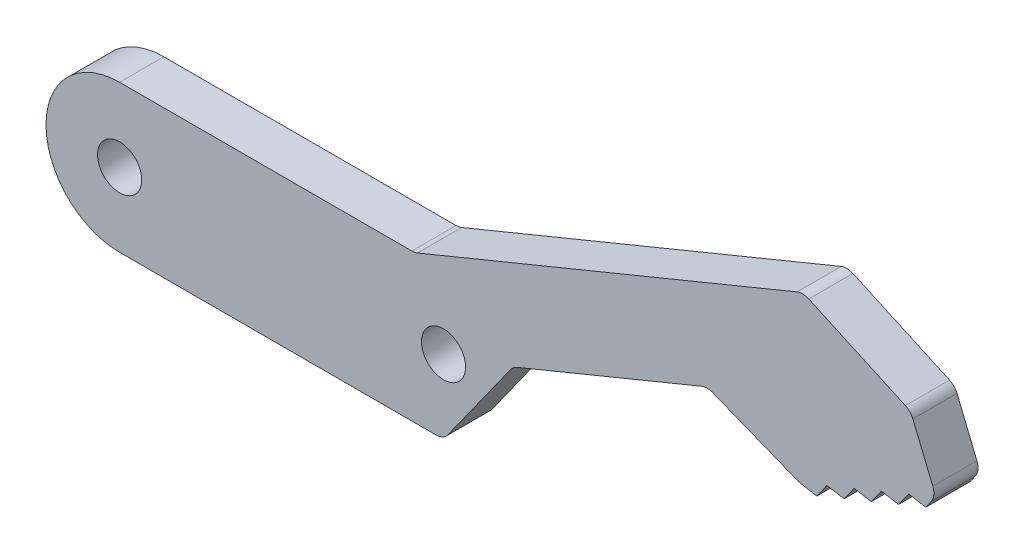
ISO-10303-21;
HEADER;
FILE_DESCRIPTION(('STEP AP214'),'2;1');
FILE_NAME('part.step','',(''),(''),'','','');
FILE_SCHEMA(('AUTOMOTIVE_DESIGN { 1 0 10303 214 1 1 1 1 }'));
ENDSEC;
DATA;
#1=APPLICATION_CONTEXT('core data for automotive mechanical design processes');
#2=APPLICATION_PROTOCOL_DEFINITION('international standard','automotive_design',2000,#1);
#3=PRODUCT_CONTEXT('',#1,'mechanical');
#4=PRODUCT('Part','Part','',(#3));
#5=PRODUCT_RELATED_PRODUCT_CATEGORY('part','',(#4));
#6=PRODUCT_DEFINITION_FORMATION('','',#4);
#7=PRODUCT_DEFINITION_CONTEXT('part definition',#1,'design');
#8=PRODUCT_DEFINITION('design','',#6,#7);
#9=PRODUCT_DEFINITION_SHAPE('','',#8);
#10=(LENGTH_UNIT() NAMED_UNIT(*) SI_UNIT(.MILLI.,.METRE.));
#11=(NAMED_UNIT(*) PLANE_ANGLE_UNIT() SI_UNIT($,.RADIAN.));
#12=(NAMED_UNIT(*) SI_UNIT($,.STERADIAN.) SOLID_ANGLE_UNIT());
#13=UNCERTAINTY_MEASURE_WITH_UNIT(LENGTH_MEASURE(1.E-05),#10,'distance_accuracy_value','');
#14=(GEOMETRIC_REPRESENTATION_CONTEXT(3) GLOBAL_UNCERTAINTY_ASSIGNED_CONTEXT((#13)) GLOBAL_UNIT_ASSIGNED_CONTEXT((#10,
#11,#12)) REPRESENTATION_CONTEXT('',''));
#15=CARTESIAN_POINT('',(0.,0.,0.));
#16=DIRECTION('',(0.,0.,1.));
#17=DIRECTION('',(1.,0.,0.));
#18=AXIS2_PLACEMENT_3D('',#15,#16,#17);
#19=CARTESIAN_POINT('',(16.9314341640706,-12.095211761983,3.));
#20=DIRECTION('',(0.813703233651607,-0.581280523968349,0.));
#21=DIRECTION('',(0.581280523968349,0.813703233651607,0.));
#22=AXIS2_PLACEMENT_3D('',#19,#20,#21);
#23=PLANE('',#22);
#24=DIRECTION('',(-0.581280523968349,-0.813703233651607,0.));
#25=VECTOR('',#24,1.);
#26=CARTESIAN_POINT('',(16.9314341640706,-12.095211761983,0.));
#27=LINE('',#26,#25);
#28=CARTESIAN_POINT('',(26.562618493048,1.38696338278467,0.));
#29=VERTEX_POINT('',#28);
#30=CARTESIAN_POINT('',(22.2991182366711,-4.58128052396835,0.));
#31=VERTEX_POINT('',#30);
#32=EDGE_CURVE('E370',#29,#31,#27,.T.);
#33=ORIENTED_EDGE('',*,*,#32,.F.);
#34=DIRECTION('',(0.,0.,-1.));
#35=VECTOR('',#34,1.);
#36=CARTESIAN_POINT('',(26.562618493048,1.38696338278467,3.));
#37=LINE('',#36,#35);
#38=CARTESIAN_POINT('',(26.562618493048,1.38696338278467,3.));
#39=VERTEX_POINT('',#38);
#40=EDGE_CURVE('E337',#29,#39,#37,.F.);
#41=ORIENTED_EDGE('',*,*,#40,.T.);
#42=DIRECTION('',(-0.581280523968349,-0.813703233651607,0.));
#43=VECTOR('',#42,1.);
#44=CARTESIAN_POINT('',(16.9314341640706,-12.095211761983,3.));
#45=LINE('',#44,#43);
#46=CARTESIAN_POINT('',(22.2991182366711,-4.58128052396835,3.));
#47=VERTEX_POINT('',#46);
#48=EDGE_CURVE('E382',#39,#47,#45,.T.);
#49=ORIENTED_EDGE('',*,*,#48,.T.);
#50=DIRECTION('',(0.,0.,-1.));
#51=VECTOR('',#50,1.);
#52=CARTESIAN_POINT('',(22.2991182366711,-4.58128052396835,0.));
#53=LINE('',#52,#51);
#54=EDGE_CURVE('E333',#47,#31,#53,.T.);
#55=ORIENTED_EDGE('',*,*,#54,.T.);
#56=EDGE_LOOP('',(#33,#41,#49,#55));
#57=FACE_BOUND('',#56,.T.);
#58=ADVANCED_FACE('F41',(#57),#23,.T.);
#59=CARTESIAN_POINT('',(3.2950033831404,-8.01412070884608,3.));
#60=DIRECTION('',(0.380263412733207,-0.924878228166549,0.));
#61=DIRECTION('',(0.924878228166549,0.380263412733207,0.));
#62=AXIS2_PLACEMENT_3D('',#59,#60,#61);
#63=PLANE('',#62);
#64=DIRECTION('',(-0.924878228166549,-0.380263412733207,0.));
#65=VECTOR('',#64,1.);
#66=CARTESIAN_POINT('',(3.2950033831404,-8.01412070884608,3.));
#67=LINE('',#66,#65);
#68=CARTESIAN_POINT('',(39.5264893293259,6.88244413040184,3.));
#69=VERTEX_POINT('',#68);
#70=CARTESIAN_POINT('',(26.9960583139664,1.73056108698287,3.));
#71=VERTEX_POINT('',#70);
#72=EDGE_CURVE('E375',#69,#71,#67,.T.);
#73=ORIENTED_EDGE('',*,*,#72,.T.);
#74=DIRECTION('',(0.,0.,-1.));
#75=VECTOR('',#74,1.);
#76=CARTESIAN_POINT('',(26.9960583139664,1.73056108698286,0.));
#77=LINE('',#76,#75);
#78=CARTESIAN_POINT('',(26.9960583139664,1.73056108698287,0.));
#79=VERTEX_POINT('',#78);
#80=EDGE_CURVE('E329',#71,#79,#77,.T.);
#81=ORIENTED_EDGE('',*,*,#80,.T.);
#82=DIRECTION('',(-0.924878228166549,-0.380263412733207,0.));
#83=VECTOR('',#82,1.);
#84=CARTESIAN_POINT('',(3.2950033831404,-8.01412070884608,0.));
#85=LINE('',#84,#83);
#86=CARTESIAN_POINT('',(39.5264893293259,6.88244413040184,0.));
#87=VERTEX_POINT('',#86);
#88=EDGE_CURVE('E358',#87,#79,#85,.T.);
#89=ORIENTED_EDGE('',*,*,#88,.F.);
#90=DIRECTION('',(0.,0.,-1.));
#91=VECTOR('',#90,1.);
#92=CARTESIAN_POINT('',(39.5264893293259,6.88244413040183,3.));
#93=LINE('',#92,#91);
#94=EDGE_CURVE('E326',#87,#69,#93,.F.);
#95=ORIENTED_EDGE('',*,*,#94,.T.);
#96=EDGE_LOOP('',(#73,#81,#89,#95));
#97=FACE_BOUND('',#96,.T.);
#98=ADVANCED_FACE('F366',(#97),#63,.T.);
#99=CARTESIAN_POINT('',(7.84369243763637,19.7605066346556,3.));
#100=DIRECTION('',(-0.368935795459582,-0.929454882621317,0.));
#101=DIRECTION('',(0.929454882621317,-0.368935795459582,0.));
#102=AXIS2_PLACEMENT_3D('',#99,#100,#101);
#103=PLANE('',#102);
#104=DIRECTION('',(-0.929454882621317,0.368935795459582,0.));
#105=VECTOR('',#104,1.);
#106=CARTESIAN_POINT('',(7.84369243763637,19.7605066346556,0.));
#107=LINE('',#106,#105);
#108=CARTESIAN_POINT('',(46.0925277874036,4.57809729019015,0.));
#109=VERTEX_POINT('',#108);
#110=CARTESIAN_POINT('',(40.2756885375187,6.8870207848566,0.));
#111=VERTEX_POINT('',#110);
#112=EDGE_CURVE('E360',#109,#111,#107,.T.);
#113=ORIENTED_EDGE('',*,*,#112,.F.);
#114=DIRECTION('',(0.,0.,-1.));
#115=VECTOR('',#114,1.);
#116=CARTESIAN_POINT('',(46.0925277874036,4.57809729019016,3.));
#117=LINE('',#116,#115);
#118=CARTESIAN_POINT('',(46.0925277874036,4.57809729019015,3.));
#119=VERTEX_POINT('',#118);
#120=EDGE_CURVE('E281',#109,#119,#117,.F.);
#121=ORIENTED_EDGE('',*,*,#120,.T.);
#122=DIRECTION('',(-0.929454882621317,0.368935795459582,0.));
#123=VECTOR('',#122,1.);
#124=CARTESIAN_POINT('',(7.84369243763637,19.7605066346556,3.));
#125=LINE('',#124,#123);
#126=CARTESIAN_POINT('',(40.2756885375187,6.8870207848566,3.));
#127=VERTEX_POINT('',#126);
#128=EDGE_CURVE('E236',#119,#127,#125,.T.);
#129=ORIENTED_EDGE('',*,*,#128,.T.);
#130=DIRECTION('',(0.,0.,-1.));
#131=VECTOR('',#130,1.);
#132=CARTESIAN_POINT('',(40.2756885375187,6.88702078485661,0.));
#133=LINE('',#132,#131);
#134=EDGE_CURVE('E277',#127,#111,#133,.T.);
#135=ORIENTED_EDGE('',*,*,#134,.T.);
#136=EDGE_LOOP('',(#113,#121,#129,#135));
#137=FACE_BOUND('',#136,.T.);
#138=ADVANCED_FACE('F377',(#137),#103,.T.);
#139=CARTESIAN_POINT('',(2.1206872505527,12.200106201943,3.));
#140=DIRECTION('',(0.171257275030372,0.985226342395072,0.));
#141=DIRECTION('',(-0.985226342395072,0.171257275030372,0.));
#142=AXIS2_PLACEMENT_3D('',#139,#140,#141);
#143=PLANE('',#142);
#144=DIRECTION('',(0.985226342395072,-0.171257275030372,0.));
#145=VECTOR('',#144,1.);
#146=CARTESIAN_POINT('',(2.1206872505527,12.200106201943,3.));
#147=LINE('',#146,#145);
#148=CARTESIAN_POINT('',(46.2902063078328,4.5223258304164,3.));
#149=VERTEX_POINT('',#148);
#150=CARTESIAN_POINT('',(47.3529322035688,4.33759717145107,3.));
#151=VERTEX_POINT('',#150);
#152=EDGE_CURVE('E222',#149,#151,#147,.T.);
#153=ORIENTED_EDGE('',*,*,#152,.F.);
#154=DIRECTION('',(0.,0.,-1.));
#155=VECTOR('',#154,1.);
#156=CARTESIAN_POINT('',(46.2902063078328,4.5223258304164,0.));
#157=LINE('',#156,#155);
#158=CARTESIAN_POINT('',(46.2902063078328,4.5223258304164,0.));
#159=VERTEX_POINT('',#158);
#160=EDGE_CURVE('E253',#149,#159,#157,.T.);
#161=ORIENTED_EDGE('',*,*,#160,.T.);
#162=DIRECTION('',(0.985226342395072,-0.171257275030372,0.));
#163=VECTOR('',#162,1.);
#164=CARTESIAN_POINT('',(2.1206872505527,12.200106201943,0.));
#165=LINE('',#164,#163);
#166=CARTESIAN_POINT('',(47.3529322035688,4.33759717145107,0.));
#167=VERTEX_POINT('',#166);
#168=EDGE_CURVE('E250',#159,#167,#165,.T.);
#169=ORIENTED_EDGE('',*,*,#168,.T.);
#170=DIRECTION('',(0.,0.,-1.));
#171=VECTOR('',#170,1.);
#172=CARTESIAN_POINT('',(47.3529322035688,4.33759717145107,3.));
#173=LINE('',#172,#171);
#174=EDGE_CURVE('E242',#151,#167,#173,.T.);
#175=ORIENTED_EDGE('',*,*,#174,.F.);
#176=EDGE_LOOP('',(#153,#161,#169,#175));
#177=FACE_BOUND('',#176,.T.);
#178=ADVANCED_FACE('F248',(#177),#143,.F.);
#179=CARTESIAN_POINT('',(29.3832302084348,-20.911746854221,3.));
#180=DIRECTION('',(-0.814732571298571,0.579836905746106,0.));
#181=DIRECTION('',(-0.579836905746106,-0.814732571298571,0.));
#182=AXIS2_PLACEMENT_3D('',#179,#180,#181);
#183=PLANE('',#182);
#184=DIRECTION('',(0.579836905746106,0.814732571298571,0.));
#185=VECTOR('',#184,1.);
#186=CARTESIAN_POINT('',(29.3832302084348,-20.911746854221,0.));
#187=LINE('',#186,#185);
#188=CARTESIAN_POINT('',(48.0382444817135,5.30053386792921,0.));
#189=VERTEX_POINT('',#188);
#190=EDGE_CURVE('E454',#167,#189,#187,.T.);
#191=ORIENTED_EDGE('',*,*,#190,.T.);
#192=DIRECTION('',(0.,0.,-1.));
#193=VECTOR('',#192,1.);
#194=CARTESIAN_POINT('',(48.0382444817135,5.30053386792921,3.));
#195=LINE('',#194,#193);
#196=CARTESIAN_POINT('',(48.0382444817135,5.30053386792921,3.));
#197=VERTEX_POINT('',#196);
#198=EDGE_CURVE('E244',#197,#189,#195,.T.);
#199=ORIENTED_EDGE('',*,*,#198,.F.);
#200=DIRECTION('',(0.579836905746106,0.814732571298571,0.));
#201=VECTOR('',#200,1.);
#202=CARTESIAN_POINT('',(29.3832302084348,-20.911746854221,3.));
#203=LINE('',#202,#201);
#204=EDGE_CURVE('E227',#151,#197,#203,.T.);
#205=ORIENTED_EDGE('',*,*,#204,.F.);
#206=ORIENTED_EDGE('',*,*,#174,.T.);
#207=EDGE_LOOP('',(#191,#199,#205,#206));
#208=FACE_BOUND('',#207,.T.);
#209=ADVANCED_FACE('F241',(#208),#183,.F.);
#210=CARTESIAN_POINT('',(2.30326040358784,13.2504316830208,3.));
#211=DIRECTION('',(0.171257275030372,0.985226342395072,0.));
#212=DIRECTION('',(-0.985226342395072,0.171257275030372,0.));
#213=AXIS2_PLACEMENT_3D('',#210,#211,#212);
#214=PLANE('',#213);
#215=DIRECTION('',(0.985226342395072,-0.171257275030372,0.));
#216=VECTOR('',#215,1.);
#217=CARTESIAN_POINT('',(2.30326040358784,13.2504316830208,0.));
#218=LINE('',#217,#216);
#219=CARTESIAN_POINT('',(49.2026886599019,5.09812399691748,0.));
#220=VERTEX_POINT('',#219);
#221=EDGE_CURVE('E457',#189,#220,#218,.T.);
#222=ORIENTED_EDGE('',*,*,#221,.T.);
#223=DIRECTION('',(0.,0.,-1.));
#224=VECTOR('',#223,1.);
#225=CARTESIAN_POINT('',(49.2026886599019,5.09812399691748,3.));
#226=LINE('',#225,#224);
#227=CARTESIAN_POINT('',(49.2026886599019,5.09812399691748,3.));
#228=VERTEX_POINT('',#227);
#229=EDGE_CURVE('E259',#228,#220,#226,.T.);
#230=ORIENTED_EDGE('',*,*,#229,.F.);
#231=DIRECTION('',(0.985226342395072,-0.171257275030372,0.));
#232=VECTOR('',#231,1.);
#233=CARTESIAN_POINT('',(2.30326040358784,13.2504316830208,3.));
#234=LINE('',#233,#232);
#235=EDGE_CURVE('E246',#197,#228,#234,.T.);
#236=ORIENTED_EDGE('',*,*,#235,.F.);
#237=ORIENTED_EDGE('',*,*,#198,.T.);
#238=EDGE_LOOP('',(#222,#230,#236,#237));
#239=FACE_BOUND('',#238,.T.);
#240=ADVANCED_FACE('F549',(#239),#214,.F.);
#241=CARTESIAN_POINT('',(30.2517964891725,-21.5298966648461,3.));
#242=DIRECTION('',(-0.814732571298572,0.579836905746105,0.));
#243=DIRECTION('',(-0.579836905746105,-0.814732571298572,0.));
#244=AXIS2_PLACEMENT_3D('',#241,#242,#243);
#245=PLANE('',#244);
#246=DIRECTION('',(0.579836905746105,0.814732571298572,0.));
#247=VECTOR('',#246,1.);
#248=CARTESIAN_POINT('',(30.2517964891725,-21.5298966648461,0.));
#249=LINE('',#248,#247);
#250=CARTESIAN_POINT('',(49.8880009380465,6.06106069339561,0.));
#251=VERTEX_POINT('',#250);
#252=EDGE_CURVE('E461',#220,#251,#249,.T.);
#253=ORIENTED_EDGE('',*,*,#252,.T.);
#254=DIRECTION('',(0.,0.,-1.));
#255=VECTOR('',#254,1.);
#256=CARTESIAN_POINT('',(49.8880009380465,6.06106069339561,3.));
#257=LINE('',#256,#255);
#258=CARTESIAN_POINT('',(49.8880009380465,6.06106069339561,3.));
#259=VERTEX_POINT('',#258);
#260=EDGE_CURVE('E539',#259,#251,#257,.T.);
#261=ORIENTED_EDGE('',*,*,#260,.F.);
#262=DIRECTION('',(0.579836905746105,0.814732571298572,0.));
#263=VECTOR('',#262,1.);
#264=CARTESIAN_POINT('',(30.2517964891725,-21.5298966648461,3.));
#265=LINE('',#264,#263);
#266=EDGE_CURVE('E388',#228,#259,#265,.T.);
#267=ORIENTED_EDGE('',*,*,#266,.F.);
#268=ORIENTED_EDGE('',*,*,#229,.T.);
#269=EDGE_LOOP('',(#253,#261,#267,#268));
#270=FACE_BOUND('',#269,.T.);
#271=ADVANCED_FACE('F546',(#270),#245,.F.);
#272=CARTESIAN_POINT('',(2.48583355662275,14.3007571640981,3.));
#273=DIRECTION('',(0.171257275030362,0.985226342395074,0.));
#274=DIRECTION('',(-0.985226342395074,0.171257275030362,0.));
#275=AXIS2_PLACEMENT_3D('',#272,#273,#274);
#276=PLANE('',#275);
#277=DIRECTION('',(0.985226342395074,-0.171257275030362,0.));
#278=VECTOR('',#277,1.);
#279=CARTESIAN_POINT('',(2.48583355662275,14.3007571640981,0.));
#280=LINE('',#279,#278);
#281=CARTESIAN_POINT('',(51.052445116235,5.8586508223839,0.));
#282=VERTEX_POINT('',#281);
#283=EDGE_CURVE('E465',#251,#282,#280,.T.);
#284=ORIENTED_EDGE('',*,*,#283,.T.);
#285=DIRECTION('',(0.,0.,-1.));
#286=VECTOR('',#285,1.);
#287=CARTESIAN_POINT('',(51.052445116235,5.8586508223839,3.));
#288=LINE('',#287,#286);
#289=CARTESIAN_POINT('',(51.052445116235,5.8586508223839,3.));
#290=VERTEX_POINT('',#289);
#291=EDGE_CURVE('E535',#290,#282,#288,.T.);
#292=ORIENTED_EDGE('',*,*,#291,.F.);
#293=DIRECTION('',(0.985226342395074,-0.171257275030362,0.));
#294=VECTOR('',#293,1.);
#295=CARTESIAN_POINT('',(2.48583355662275,14.3007571640981,3.));
#296=LINE('',#295,#294);
#297=EDGE_CURVE('E392',#259,#290,#296,.T.);
#298=ORIENTED_EDGE('',*,*,#297,.F.);
#299=ORIENTED_EDGE('',*,*,#260,.T.);
#300=EDGE_LOOP('',(#284,#292,#298,#299));
#301=FACE_BOUND('',#300,.T.);
#302=ADVANCED_FACE('F552',(#301),#276,.F.);
#303=CARTESIAN_POINT('',(31.1203627699109,-22.1480464754711,3.));
#304=DIRECTION('',(-0.81473257129858,0.579836905746093,0.));
#305=DIRECTION('',(-0.579836905746093,-0.81473257129858,0.));
#306=AXIS2_PLACEMENT_3D('',#303,#304,#305);
#307=PLANE('',#306);
#308=DIRECTION('',(0.579836905746093,0.81473257129858,0.));
#309=VECTOR('',#308,1.);
#310=CARTESIAN_POINT('',(31.1203627699109,-22.1480464754711,0.));
#311=LINE('',#310,#309);
#312=CARTESIAN_POINT('',(51.7377573943796,6.82158751886202,0.));
#313=VERTEX_POINT('',#312);
#314=EDGE_CURVE('E469',#282,#313,#311,.T.);
#315=ORIENTED_EDGE('',*,*,#314,.T.);
#316=DIRECTION('',(0.,0.,-1.));
#317=VECTOR('',#316,1.);
#318=CARTESIAN_POINT('',(51.7377573943796,6.82158751886202,3.));
#319=LINE('',#318,#317);
#320=CARTESIAN_POINT('',(51.7377573943796,6.82158751886202,3.));
#321=VERTEX_POINT('',#320);
#322=EDGE_CURVE('E531',#321,#313,#319,.T.);
#323=ORIENTED_EDGE('',*,*,#322,.F.);
#324=DIRECTION('',(0.579836905746093,0.81473257129858,0.));
#325=VECTOR('',#324,1.);
#326=CARTESIAN_POINT('',(31.1203627699109,-22.1480464754711,3.));
#327=LINE('',#326,#325);
#328=EDGE_CURVE('E396',#290,#321,#327,.T.);
#329=ORIENTED_EDGE('',*,*,#328,.F.);
#330=ORIENTED_EDGE('',*,*,#291,.T.);
#331=EDGE_LOOP('',(#315,#323,#329,#330));
#332=FACE_BOUND('',#331,.T.);
#333=ADVANCED_FACE('F556',(#332),#307,.F.);
#334=CARTESIAN_POINT('',(2.66840670965787,15.3510826451758,3.));
#335=DIRECTION('',(0.171257275030363,0.985226342395073,0.));
#336=DIRECTION('',(-0.985226342395074,0.171257275030363,0.));
#337=AXIS2_PLACEMENT_3D('',#334,#335,#336);
#338=PLANE('',#337);
#339=DIRECTION('',(0.985226342395074,-0.171257275030363,0.));
#340=VECTOR('',#339,1.);
#341=CARTESIAN_POINT('',(2.66840670965787,15.3510826451758,0.));
#342=LINE('',#341,#340);
#343=CARTESIAN_POINT('',(52.9022015725681,6.6191776478503,0.));
#344=VERTEX_POINT('',#343);
#345=EDGE_CURVE('E473',#313,#344,#342,.T.);
#346=ORIENTED_EDGE('',*,*,#345,.T.);
#347=DIRECTION('',(0.,0.,-1.));
#348=VECTOR('',#347,1.);
#349=CARTESIAN_POINT('',(52.9022015725681,6.6191776478503,3.));
#350=LINE('',#349,#348);
#351=CARTESIAN_POINT('',(52.9022015725681,6.6191776478503,3.));
#352=VERTEX_POINT('',#351);
#353=EDGE_CURVE('E527',#352,#344,#350,.T.);
#354=ORIENTED_EDGE('',*,*,#353,.F.);
#355=DIRECTION('',(0.985226342395074,-0.171257275030363,0.));
#356=VECTOR('',#355,1.);
#357=CARTESIAN_POINT('',(2.66840670965787,15.3510826451758,3.));
#358=LINE('',#357,#356);
#359=EDGE_CURVE('E400',#321,#352,#358,.T.);
#360=ORIENTED_EDGE('',*,*,#359,.F.);
#361=ORIENTED_EDGE('',*,*,#322,.T.);
#362=EDGE_LOOP('',(#346,#354,#360,#361));
#363=FACE_BOUND('',#362,.T.);
#364=ADVANCED_FACE('F558',(#363),#338,.F.);
#365=CARTESIAN_POINT('',(31.9889290506483,-22.7661962860963,3.));
#366=DIRECTION('',(-0.814732571298577,0.579836905746098,0.));
#367=DIRECTION('',(-0.579836905746098,-0.814732571298577,0.));
#368=AXIS2_PLACEMENT_3D('',#365,#366,#367);
#369=PLANE('',#368);
#370=DIRECTION('',(0.579836905746098,0.814732571298577,0.));
#371=VECTOR('',#370,1.);
#372=CARTESIAN_POINT('',(31.9889290506483,-22.7661962860963,0.));
#373=LINE('',#372,#371);
#374=CARTESIAN_POINT('',(53.5875138507127,7.58211434432845,0.));
#375=VERTEX_POINT('',#374);
#376=EDGE_CURVE('E477',#344,#375,#373,.T.);
#377=ORIENTED_EDGE('',*,*,#376,.T.);
#378=DIRECTION('',(0.,0.,-1.));
#379=VECTOR('',#378,1.);
#380=CARTESIAN_POINT('',(53.5875138507127,7.58211434432845,3.));
#381=LINE('',#380,#379);
#382=CARTESIAN_POINT('',(53.5875138507127,7.58211434432845,3.));
#383=VERTEX_POINT('',#382);
#384=EDGE_CURVE('E523',#383,#375,#381,.T.);
#385=ORIENTED_EDGE('',*,*,#384,.F.);
#386=DIRECTION('',(0.579836905746098,0.814732571298577,0.));
#387=VECTOR('',#386,1.);
#388=CARTESIAN_POINT('',(31.9889290506483,-22.7661962860963,3.));
#389=LINE('',#388,#387);
#390=EDGE_CURVE('E404',#352,#383,#389,.T.);
#391=ORIENTED_EDGE('',*,*,#390,.F.);
#392=ORIENTED_EDGE('',*,*,#353,.T.);
#393=EDGE_LOOP('',(#377,#385,#391,#392));
#394=FACE_BOUND('',#393,.T.);
#395=ADVANCED_FACE('F560',(#394),#369,.F.);
#396=CARTESIAN_POINT('',(2.8509798626931,16.4014081262537,3.));
#397=DIRECTION('',(0.171257275030367,0.985226342395073,0.));
#398=DIRECTION('',(-0.985226342395073,0.171257275030367,0.));
#399=AXIS2_PLACEMENT_3D('',#396,#397,#398);
#400=PLANE('',#399);
#401=DIRECTION('',(0.985226342395073,-0.171257275030367,0.));
#402=VECTOR('',#401,1.);
#403=CARTESIAN_POINT('',(2.8509798626931,16.4014081262537,0.));
#404=LINE('',#403,#402);
#405=CARTESIAN_POINT('',(54.7519580289012,7.37970447331672,0.));
#406=VERTEX_POINT('',#405);
#407=EDGE_CURVE('E481',#375,#406,#404,.T.);
#408=ORIENTED_EDGE('',*,*,#407,.T.);
#409=DIRECTION('',(0.,0.,-1.));
#410=VECTOR('',#409,1.);
#411=CARTESIAN_POINT('',(54.7519580289012,7.37970447331672,3.));
#412=LINE('',#411,#410);
#413=CARTESIAN_POINT('',(54.7519580289012,7.37970447331672,3.));
#414=VERTEX_POINT('',#413);
#415=EDGE_CURVE('E519',#414,#406,#412,.T.);
#416=ORIENTED_EDGE('',*,*,#415,.F.);
#417=DIRECTION('',(0.985226342395073,-0.171257275030367,0.));
#418=VECTOR('',#417,1.);
#419=CARTESIAN_POINT('',(2.8509798626931,16.4014081262537,3.));
#420=LINE('',#419,#418);
#421=EDGE_CURVE('E408',#383,#414,#420,.T.);
#422=ORIENTED_EDGE('',*,*,#421,.F.);
#423=ORIENTED_EDGE('',*,*,#384,.T.);
#424=EDGE_LOOP('',(#408,#416,#422,#423));
#425=FACE_BOUND('',#424,.T.);
#426=ADVANCED_FACE('F565',(#425),#400,.F.);
#427=CARTESIAN_POINT('',(32.8574953313852,-23.3843460967216,3.));
#428=DIRECTION('',(-0.814732571298569,0.579836905746109,0.));
#429=DIRECTION('',(-0.579836905746109,-0.814732571298569,0.));
#430=AXIS2_PLACEMENT_3D('',#427,#428,#429);
#431=PLANE('',#430);
#432=DIRECTION('',(0.579836905746109,0.814732571298569,0.));
#433=VECTOR('',#432,1.);
#434=CARTESIAN_POINT('',(32.8574953313852,-23.3843460967216,0.));
#435=LINE('',#434,#433);
#436=CARTESIAN_POINT('',(55.1172552795213,7.89298599323484,0.));
#437=VERTEX_POINT('',#436);
#438=EDGE_CURVE('E485',#406,#437,#435,.T.);
#439=ORIENTED_EDGE('',*,*,#438,.T.);
#440=DIRECTION('',(0.,0.,-1.));
#441=VECTOR('',#440,1.);
#442=CARTESIAN_POINT('',(55.1172552795213,7.89298599323484,3.));
#443=LINE('',#442,#441);
#444=CARTESIAN_POINT('',(55.1172552795213,7.89298599323484,3.));
#445=VERTEX_POINT('',#444);
#446=EDGE_CURVE('E305',#437,#445,#443,.F.);
#447=ORIENTED_EDGE('',*,*,#446,.T.);
#448=DIRECTION('',(0.579836905746109,0.814732571298569,0.));
#449=VECTOR('',#448,1.);
#450=CARTESIAN_POINT('',(32.8574953313852,-23.3843460967216,3.));
#451=LINE('',#450,#449);
#452=EDGE_CURVE('E412',#414,#445,#451,.T.);
#453=ORIENTED_EDGE('',*,*,#452,.F.);
#454=ORIENTED_EDGE('',*,*,#415,.T.);
#455=EDGE_LOOP('',(#439,#447,#453,#454));
#456=FACE_BOUND('',#455,.T.);
#457=ADVANCED_FACE('F567',(#456),#431,.F.);
#458=CARTESIAN_POINT('',(50.3551112402657,20.7034892439219,3.));
#459=DIRECTION('',(0.924878228166549,0.380263412733207,0.));
#460=DIRECTION('',(-0.380263412733207,0.924878228166549,0.));
#461=AXIS2_PLACEMENT_3D('',#458,#459,#460);
#462=PLANE('',#461);
#463=DIRECTION('',(0.380263412733207,-0.924878228166549,0.));
#464=VECTOR('',#463,1.);
#465=CARTESIAN_POINT('',(50.3551112402657,20.7034892439219,3.));
#466=LINE('',#465,#464);
#467=CARTESIAN_POINT('',(53.8764912996726,12.138774256918,3.));
#468=VERTEX_POINT('',#467);
#469=CARTESIAN_POINT('',(55.2274009363892,8.85308631171415,3.));
#470=VERTEX_POINT('',#469);
#471=EDGE_CURVE('E416',#468,#470,#466,.T.);
#472=ORIENTED_EDGE('',*,*,#471,.T.);
#473=DIRECTION('',(0.,0.,-1.));
#474=VECTOR('',#473,1.);
#475=CARTESIAN_POINT('',(55.2274009363892,8.85308631171415,0.));
#476=LINE('',#475,#474);
#477=CARTESIAN_POINT('',(55.2274009363892,8.85308631171415,0.));
#478=VERTEX_POINT('',#477);
#479=EDGE_CURVE('E301',#470,#478,#476,.T.);
#480=ORIENTED_EDGE('',*,*,#479,.T.);
#481=DIRECTION('',(0.380263412733207,-0.924878228166549,0.));
#482=VECTOR('',#481,1.);
#483=CARTESIAN_POINT('',(50.3551112402657,20.7034892439219,0.));
#484=LINE('',#483,#482);
#485=CARTESIAN_POINT('',(53.8764912996726,12.138774256918,0.));
#486=VERTEX_POINT('',#485);
#487=EDGE_CURVE('E489',#486,#478,#484,.T.);
#488=ORIENTED_EDGE('',*,*,#487,.F.);
#489=DIRECTION('',(0.,0.,-1.));
#490=VECTOR('',#489,1.);
#491=CARTESIAN_POINT('',(53.8764912996726,12.138774256918,3.));
#492=LINE('',#491,#490);
#493=EDGE_CURVE('E298',#486,#468,#492,.F.);
#494=ORIENTED_EDGE('',*,*,#493,.T.);
#495=EDGE_LOOP('',(#472,#480,#488,#494));
#496=FACE_BOUND('',#495,.T.);
#497=ADVANCED_FACE('F575',(#496),#462,.T.);
#498=CARTESIAN_POINT('',(13.9488099268583,30.6231164748253,3.));
#499=DIRECTION('',(0.414522259932086,0.910039172794664,0.));
#500=DIRECTION('',(-0.910039172794664,0.414522259932086,0.));
#501=AXIS2_PLACEMENT_3D('',#498,#499,#500);
#502=PLANE('',#501);
#503=DIRECTION('',(0.910039172794664,-0.414522259932086,0.));
#504=VECTOR('',#503,1.);
#505=CARTESIAN_POINT('',(13.9488099268583,30.6231164748253,3.));
#506=LINE('',#505,#504);
#507=CARTESIAN_POINT('',(46.8032086062433,15.6579589338968,3.));
#508=VERTEX_POINT('',#507);
#509=CARTESIAN_POINT('',(53.3661353314382,12.6685500169795,3.));
#510=VERTEX_POINT('',#509);
#511=EDGE_CURVE('E420',#508,#510,#506,.T.);
#512=ORIENTED_EDGE('',*,*,#511,.T.);
#513=DIRECTION('',(0.,0.,-1.));
#514=VECTOR('',#513,1.);
#515=CARTESIAN_POINT('',(53.3661353314382,12.6685500169795,3.));
#516=LINE('',#515,#514);
#517=CARTESIAN_POINT('',(53.3661353314382,12.6685500169795,0.));
#518=VERTEX_POINT('',#517);
#519=EDGE_CURVE('E311',#510,#518,#516,.T.);
#520=ORIENTED_EDGE('',*,*,#519,.T.);
#521=DIRECTION('',(0.910039172794664,-0.414522259932086,0.));
#522=VECTOR('',#521,1.);
#523=CARTESIAN_POINT('',(13.9488099268583,30.6231164748253,0.));
#524=LINE('',#523,#522);
#525=CARTESIAN_POINT('',(46.8032086062433,15.6579589338968,0.));
#526=VERTEX_POINT('',#525);
#527=EDGE_CURVE('E493',#526,#518,#524,.T.);
#528=ORIENTED_EDGE('',*,*,#527,.F.);
#529=DIRECTION('',(0.,0.,-1.));
#530=VECTOR('',#529,1.);
#531=CARTESIAN_POINT('',(46.8032086062433,15.6579589338968,3.));
#532=LINE('',#531,#530);
#533=EDGE_CURVE('E308',#526,#508,#532,.F.);
#534=ORIENTED_EDGE('',*,*,#533,.T.);
#535=EDGE_LOOP('',(#512,#520,#528,#534));
#536=FACE_BOUND('',#535,.T.);
#537=ADVANCED_FACE('F584',(#536),#502,.T.);
#538=CARTESIAN_POINT('',(1.14074851739701,-2.77453321099285,3.));
#539=DIRECTION('',(-0.380263412733207,0.924878228166549,0.));
#540=DIRECTION('',(-0.924878228166549,-0.380263412733207,0.));
#541=AXIS2_PLACEMENT_3D('',#538,#539,#540);
#542=PLANE('',#541);
#543=DIRECTION('',(0.924878228166549,0.380263412733207,0.));
#544=VECTOR('',#543,1.);
#545=CARTESIAN_POINT('',(1.14074851739701,-2.77453321099285,3.));
#546=LINE('',#545,#544);
#547=CARTESIAN_POINT('',(20.2327114807882,5.07512177183345,3.));
#548=VERTEX_POINT('',#547);
#549=CARTESIAN_POINT('',(46.0084229335781,15.6727979892687,3.));
#550=VERTEX_POINT('',#549);
#551=EDGE_CURVE('E424',#548,#550,#546,.T.);
#552=ORIENTED_EDGE('',*,*,#551,.T.);
#553=DIRECTION('',(0.,0.,-1.));
#554=VECTOR('',#553,1.);
#555=CARTESIAN_POINT('',(46.008422933578,15.6727979892687,3.));
#556=LINE('',#555,#554);
#557=CARTESIAN_POINT('',(46.0084229335781,15.6727979892687,0.));
#558=VERTEX_POINT('',#557);
#559=EDGE_CURVE('E318',#550,#558,#556,.T.);
#560=ORIENTED_EDGE('',*,*,#559,.T.);
#561=DIRECTION('',(0.924878228166549,0.380263412733207,0.));
#562=VECTOR('',#561,1.);
#563=CARTESIAN_POINT('',(1.14074851739701,-2.77453321099285,0.));
#564=LINE('',#563,#562);
#565=CARTESIAN_POINT('',(20.2327114807882,5.07512177183345,0.));
#566=VERTEX_POINT('',#565);
#567=EDGE_CURVE('E497',#566,#558,#564,.T.);
#568=ORIENTED_EDGE('',*,*,#567,.F.);
#569=DIRECTION('',(0.,0.,-1.));
#570=VECTOR('',#569,1.);
#571=CARTESIAN_POINT('',(20.2327114807882,5.07512177183345,3.));
#572=LINE('',#571,#570);
#573=EDGE_CURVE('E315',#566,#548,#572,.F.);
#574=ORIENTED_EDGE('',*,*,#573,.T.);
#575=EDGE_LOOP('',(#552,#560,#568,#574));
#576=FACE_BOUND('',#575,.T.);
#577=ADVANCED_FACE('F591',(#576),#542,.T.);
#578=CARTESIAN_POINT('',(0.,5.,3.));
#579=DIRECTION('',(0.,1.,0.));
#580=DIRECTION('',(0.,0.,1.));
#581=AXIS2_PLACEMENT_3D('',#578,#579,#580);
#582=PLANE('',#581);
#583=DIRECTION('',(1.,0.,0.));
#584=VECTOR('',#583,1.);
#585=CARTESIAN_POINT('',(0.,5.,3.));
#586=LINE('',#585,#584);
#587=CARTESIAN_POINT('',(0.,5.,3.));
#588=VERTEX_POINT('',#587);
#589=CARTESIAN_POINT('',(19.852448068055,5.,3.));
#590=VERTEX_POINT('',#589);
#591=EDGE_CURVE('E428',#588,#590,#586,.T.);
#592=ORIENTED_EDGE('',*,*,#591,.T.);
#593=DIRECTION('',(0.,0.,-1.));
#594=VECTOR('',#593,1.);
#595=CARTESIAN_POINT('',(19.852448068055,5.,0.));
#596=LINE('',#595,#594);
#597=CARTESIAN_POINT('',(19.852448068055,5.,0.));
#598=VERTEX_POINT('',#597);
#599=EDGE_CURVE('E322',#590,#598,#596,.T.);
#600=ORIENTED_EDGE('',*,*,#599,.T.);
#601=DIRECTION('',(1.,0.,0.));
#602=VECTOR('',#601,1.);
#603=CARTESIAN_POINT('',(0.,5.,0.));
#604=LINE('',#603,#602);
#605=CARTESIAN_POINT('',(0.,5.,0.));
#606=VERTEX_POINT('',#605);
#607=EDGE_CURVE('E501',#606,#598,#604,.T.);
#608=ORIENTED_EDGE('',*,*,#607,.F.);
#609=DIRECTION('',(0.,0.,-1.));
#610=VECTOR('',#609,1.);
#611=CARTESIAN_POINT('',(0.,5.,3.));
#612=LINE('',#611,#610);
#613=EDGE_CURVE('E516',#588,#606,#612,.T.);
#614=ORIENTED_EDGE('',*,*,#613,.F.);
#615=EDGE_LOOP('',(#592,#600,#608,#614));
#616=FACE_BOUND('',#615,.T.);
#617=ADVANCED_FACE('F599',(#616),#582,.T.);
#618=CARTESIAN_POINT('',(0.,0.,3.));
#619=DIRECTION('',(0.,0.,-1.));
#620=DIRECTION('',(-1.,0.,0.));
#621=AXIS2_PLACEMENT_3D('',#618,#619,#620);
#622=CYLINDRICAL_SURFACE('',#621,5.);
#623=CARTESIAN_POINT('',(0.,0.,0.));
#624=DIRECTION('',(0.,0.,1.));
#625=DIRECTION('',(1.,0.,0.));
#626=AXIS2_PLACEMENT_3D('',#623,#624,#625);
#627=CIRCLE('',#626,5.);
#628=CARTESIAN_POINT('',(0.,-5.,0.));
#629=VERTEX_POINT('',#628);
#630=EDGE_CURVE('E505',#606,#629,#627,.T.);
#631=ORIENTED_EDGE('',*,*,#630,.T.);
#632=DIRECTION('',(0.,0.,-1.));
#633=VECTOR('',#632,1.);
#634=CARTESIAN_POINT('',(0.,-5.,3.));
#635=LINE('',#634,#633);
#636=CARTESIAN_POINT('',(0.,-5.,3.));
#637=VERTEX_POINT('',#636);
#638=EDGE_CURVE('E438',#637,#629,#635,.T.);
#639=ORIENTED_EDGE('',*,*,#638,.F.);
#640=CARTESIAN_POINT('',(0.,0.,3.));
#641=DIRECTION('',(0.,0.,1.));
#642=DIRECTION('',(1.,0.,0.));
#643=AXIS2_PLACEMENT_3D('',#640,#641,#642);
#644=CIRCLE('',#643,5.);
#645=EDGE_CURVE('E431',#588,#637,#644,.T.);
#646=ORIENTED_EDGE('',*,*,#645,.F.);
#647=ORIENTED_EDGE('',*,*,#613,.T.);
#648=EDGE_LOOP('',(#631,#639,#646,#647));
#649=FACE_BOUND('',#648,.T.);
#650=ADVANCED_FACE('F603',(#649),#622,.T.);
#651=CARTESIAN_POINT('',(0.,0.,3.));
#652=DIRECTION('',(0.,0.,-1.));
#653=DIRECTION('',(-1.,0.,0.));
#654=AXIS2_PLACEMENT_3D('',#651,#652,#653);
#655=CYLINDRICAL_SURFACE('',#654,1.5);
#656=CARTESIAN_POINT('',(0.,0.,3.));
#657=DIRECTION('',(0.,0.,1.));
#658=DIRECTION('',(1.,0.,0.));
#659=AXIS2_PLACEMENT_3D('',#656,#657,#658);
#660=CIRCLE('',#659,1.5);
#661=CARTESIAN_POINT('',(1.5,0.,3.));
#662=VERTEX_POINT('',#661);
#663=EDGE_CURVE('E617',#662,#662,#660,.T.);
#664=ORIENTED_EDGE('',*,*,#663,.T.);
#665=EDGE_LOOP('',(#664));
#666=FACE_BOUND('',#665,.T.);
#667=CARTESIAN_POINT('',(0.,0.,0.));
#668=DIRECTION('',(0.,0.,1.));
#669=DIRECTION('',(1.,0.,0.));
#670=AXIS2_PLACEMENT_3D('',#667,#668,#669);
#671=CIRCLE('',#670,1.5);
#672=CARTESIAN_POINT('',(1.5,0.,0.));
#673=VERTEX_POINT('',#672);
#674=EDGE_CURVE('E443',#673,#673,#671,.T.);
#675=ORIENTED_EDGE('',*,*,#674,.F.);
#676=EDGE_LOOP('',(#675));
#677=FACE_BOUND('',#676,.T.);
#678=ADVANCED_FACE('F635',(#666,#677),#655,.F.);
#679=CARTESIAN_POINT('',(22.,0.,3.));
#680=DIRECTION('',(0.,0.,-1.));
#681=DIRECTION('',(-1.,0.,0.));
#682=AXIS2_PLACEMENT_3D('',#679,#680,#681);
#683=CYLINDRICAL_SURFACE('',#682,1.5);
#684=CARTESIAN_POINT('',(22.,0.,3.));
#685=DIRECTION('',(0.,0.,1.));
#686=DIRECTION('',(1.,0.,0.));
#687=AXIS2_PLACEMENT_3D('',#684,#685,#686);
#688=CIRCLE('',#687,1.5);
#689=CARTESIAN_POINT('',(23.5,0.,3.));
#690=VERTEX_POINT('',#689);
#691=EDGE_CURVE('E512',#690,#690,#688,.T.);
#692=ORIENTED_EDGE('',*,*,#691,.T.);
#693=EDGE_LOOP('',(#692));
#694=FACE_BOUND('',#693,.T.);
#695=CARTESIAN_POINT('',(22.,0.,0.));
#696=DIRECTION('',(0.,0.,1.));
#697=DIRECTION('',(1.,0.,0.));
#698=AXIS2_PLACEMENT_3D('',#695,#696,#697);
#699=CIRCLE('',#698,1.5);
#700=CARTESIAN_POINT('',(23.5,0.,0.));
#701=VERTEX_POINT('',#700);
#702=EDGE_CURVE('E439',#701,#701,#699,.T.);
#703=ORIENTED_EDGE('',*,*,#702,.F.);
#704=EDGE_LOOP('',(#703));
#705=FACE_BOUND('',#704,.T.);
#706=ADVANCED_FACE('F626',(#694,#705),#683,.F.);
#707=CARTESIAN_POINT('',(0.,-5.,3.));
#708=DIRECTION('',(0.,1.,0.));
#709=DIRECTION('',(0.,0.,1.));
#710=AXIS2_PLACEMENT_3D('',#707,#708,#709);
#711=PLANE('',#710);
#712=DIRECTION('',(1.,0.,0.));
#713=VECTOR('',#712,1.);
#714=CARTESIAN_POINT('',(0.,-5.,0.));
#715=LINE('',#714,#713);
#716=CARTESIAN_POINT('',(21.4854150030195,-5.,0.));
#717=VERTEX_POINT('',#716);
#718=EDGE_CURVE('E509',#629,#717,#715,.T.);
#719=ORIENTED_EDGE('',*,*,#718,.T.);
#720=DIRECTION('',(0.,0.,-1.));
#721=VECTOR('',#720,1.);
#722=CARTESIAN_POINT('',(21.4854150030195,-5.,3.));
#723=LINE('',#722,#721);
#724=CARTESIAN_POINT('',(21.4854150030195,-5.,3.));
#725=VERTEX_POINT('',#724);
#726=EDGE_CURVE('E57',#717,#725,#723,.F.);
#727=ORIENTED_EDGE('',*,*,#726,.T.);
#728=DIRECTION('',(1.,0.,0.));
#729=VECTOR('',#728,1.);
#730=CARTESIAN_POINT('',(0.,-5.,3.));
#731=LINE('',#730,#729);
#732=EDGE_CURVE('E435',#637,#725,#731,.T.);
#733=ORIENTED_EDGE('',*,*,#732,.F.);
#734=ORIENTED_EDGE('',*,*,#638,.T.);
#735=EDGE_LOOP('',(#719,#727,#733,#734));
#736=FACE_BOUND('',#735,.T.);
#737=ADVANCED_FACE('F631',(#736),#711,.F.);
#738=CARTESIAN_POINT('',(0.,0.,3.));
#739=DIRECTION('',(0.,0.,1.));
#740=DIRECTION('',(1.,0.,0.));
#741=AXIS2_PLACEMENT_3D('',#738,#739,#740);
#742=PLANE('',#741);
#743=ORIENTED_EDGE('',*,*,#691,.F.);
#744=EDGE_LOOP('',(#743));
#745=FACE_BOUND('',#744,.T.);
#746=ORIENTED_EDGE('',*,*,#663,.F.);
#747=EDGE_LOOP('',(#746));
#748=FACE_BOUND('',#747,.T.);
#749=ORIENTED_EDGE('',*,*,#128,.F.);
#750=CARTESIAN_POINT('',(46.4614635828632,5.50755217281148,3.));
#751=DIRECTION('',(0.,0.,1.));
#752=DIRECTION('',(1.,0.,0.));
#753=AXIS2_PLACEMENT_3D('',#750,#751,#752);
#754=CIRCLE('',#753,1.);
#755=EDGE_CURVE('E230',#119,#149,#754,.T.);
#756=ORIENTED_EDGE('',*,*,#755,.T.);
#757=ORIENTED_EDGE('',*,*,#152,.T.);
#758=ORIENTED_EDGE('',*,*,#204,.T.);
#759=ORIENTED_EDGE('',*,*,#235,.T.);
#760=ORIENTED_EDGE('',*,*,#266,.T.);
#761=ORIENTED_EDGE('',*,*,#297,.T.);
#762=ORIENTED_EDGE('',*,*,#328,.T.);
#763=ORIENTED_EDGE('',*,*,#359,.T.);
#764=ORIENTED_EDGE('',*,*,#390,.T.);
#765=ORIENTED_EDGE('',*,*,#421,.T.);
#766=ORIENTED_EDGE('',*,*,#452,.T.);
#767=CARTESIAN_POINT('',(54.3025227082227,8.47282289898095,3.));
#768=DIRECTION('',(0.,0.,1.));
#769=DIRECTION('',(1.,0.,0.));
#770=AXIS2_PLACEMENT_3D('',#767,#768,#769);
#771=CIRCLE('',#770,1.);
#772=EDGE_CURVE('E293',#445,#470,#771,.T.);
#773=ORIENTED_EDGE('',*,*,#772,.T.);
#774=ORIENTED_EDGE('',*,*,#471,.F.);
#775=CARTESIAN_POINT('',(52.9516130715061,11.7585108441848,3.));
#776=DIRECTION('',(0.,0.,1.));
#777=DIRECTION('',(1.,0.,0.));
#778=AXIS2_PLACEMENT_3D('',#775,#776,#777);
#779=CIRCLE('',#778,1.);
#780=EDGE_CURVE('E290',#468,#510,#779,.T.);
#781=ORIENTED_EDGE('',*,*,#780,.T.);
#782=ORIENTED_EDGE('',*,*,#511,.F.);
#783=CARTESIAN_POINT('',(46.3886863463112,14.7479197611021,3.));
#784=DIRECTION('',(0.,0.,1.));
#785=DIRECTION('',(1.,0.,0.));
#786=AXIS2_PLACEMENT_3D('',#783,#784,#785);
#787=CIRCLE('',#786,1.);
#788=EDGE_CURVE('E287',#508,#550,#787,.T.);
#789=ORIENTED_EDGE('',*,*,#788,.T.);
#790=ORIENTED_EDGE('',*,*,#551,.F.);
#791=CARTESIAN_POINT('',(19.852448068055,6.,3.));
#792=DIRECTION('',(0.,0.,1.));
#793=DIRECTION('',(1.,0.,0.));
#794=AXIS2_PLACEMENT_3D('',#791,#792,#793);
#795=CIRCLE('',#794,1.);
#796=EDGE_CURVE('E65',#548,#590,#795,.F.);
#797=ORIENTED_EDGE('',*,*,#796,.T.);
#798=ORIENTED_EDGE('',*,*,#591,.F.);
#799=ORIENTED_EDGE('',*,*,#645,.T.);
#800=ORIENTED_EDGE('',*,*,#732,.T.);
#801=CARTESIAN_POINT('',(21.4854150030195,-4.,3.));
#802=DIRECTION('',(0.,0.,1.));
#803=DIRECTION('',(1.,0.,0.));
#804=AXIS2_PLACEMENT_3D('',#801,#802,#803);
#805=CIRCLE('',#804,1.);
#806=EDGE_CURVE('E284',#725,#47,#805,.T.);
#807=ORIENTED_EDGE('',*,*,#806,.T.);
#808=ORIENTED_EDGE('',*,*,#48,.F.);
#809=CARTESIAN_POINT('',(27.3763217266996,0.805682858816315,3.));
#810=DIRECTION('',(0.,0.,1.));
#811=DIRECTION('',(1.,0.,0.));
#812=AXIS2_PLACEMENT_3D('',#809,#810,#811);
#813=CIRCLE('',#812,1.);
#814=EDGE_CURVE('E350',#39,#71,#813,.F.);
#815=ORIENTED_EDGE('',*,*,#814,.T.);
#816=ORIENTED_EDGE('',*,*,#72,.F.);
#817=CARTESIAN_POINT('',(39.9067527420591,5.95756590223529,3.));
#818=DIRECTION('',(0.,0.,1.));
#819=DIRECTION('',(1.,0.,0.));
#820=AXIS2_PLACEMENT_3D('',#817,#818,#819);
#821=CIRCLE('',#820,1.);
#822=EDGE_CURVE('E11',#69,#127,#821,.F.);
#823=ORIENTED_EDGE('',*,*,#822,.T.);
#824=EDGE_LOOP('',(#749,#756,#757,#758,#759,#760,#761,#762,#763,#764,#765,#766,#773,#774,#781,
#782,#789,#790,#797,#798,#799,#800,#807,#808,#815,#816,#823));
#825=FACE_BOUND('',#824,.T.);
#826=ADVANCED_FACE('F225',(#745,#748,#825),#742,.T.);
#827=CARTESIAN_POINT('',(0.,0.,0.));
#828=DIRECTION('',(0.,0.,1.));
#829=DIRECTION('',(1.,0.,0.));
#830=AXIS2_PLACEMENT_3D('',#827,#828,#829);
#831=PLANE('',#830);
#832=ORIENTED_EDGE('',*,*,#702,.T.);
#833=EDGE_LOOP('',(#832));
#834=FACE_BOUND('',#833,.T.);
#835=ORIENTED_EDGE('',*,*,#674,.T.);
#836=EDGE_LOOP('',(#835));
#837=FACE_BOUND('',#836,.T.);
#838=ORIENTED_EDGE('',*,*,#168,.F.);
#839=CARTESIAN_POINT('',(46.4614635828632,5.50755217281148,0.));
#840=DIRECTION('',(0.,0.,1.));
#841=DIRECTION('',(1.,0.,0.));
#842=AXIS2_PLACEMENT_3D('',#839,#840,#841);
#843=CIRCLE('',#842,1.);
#844=EDGE_CURVE('E274',#159,#109,#843,.F.);
#845=ORIENTED_EDGE('',*,*,#844,.T.);
#846=ORIENTED_EDGE('',*,*,#112,.T.);
#847=CARTESIAN_POINT('',(39.9067527420591,5.95756590223529,0.));
#848=DIRECTION('',(0.,0.,1.));
#849=DIRECTION('',(1.,0.,0.));
#850=AXIS2_PLACEMENT_3D('',#847,#848,#849);
#851=CIRCLE('',#850,1.);
#852=EDGE_CURVE('E50',#111,#87,#851,.T.);
#853=ORIENTED_EDGE('',*,*,#852,.T.);
#854=ORIENTED_EDGE('',*,*,#88,.T.);
#855=CARTESIAN_POINT('',(27.3763217266996,0.805682858816315,0.));
#856=DIRECTION('',(0.,0.,1.));
#857=DIRECTION('',(1.,0.,0.));
#858=AXIS2_PLACEMENT_3D('',#855,#856,#857);
#859=CIRCLE('',#858,1.);
#860=EDGE_CURVE('E347',#79,#29,#859,.T.);
#861=ORIENTED_EDGE('',*,*,#860,.T.);
#862=ORIENTED_EDGE('',*,*,#32,.T.);
#863=CARTESIAN_POINT('',(21.4854150030195,-4.,0.));
#864=DIRECTION('',(0.,0.,1.));
#865=DIRECTION('',(1.,0.,0.));
#866=AXIS2_PLACEMENT_3D('',#863,#864,#865);
#867=CIRCLE('',#866,1.);
#868=EDGE_CURVE('E257',#31,#717,#867,.F.);
#869=ORIENTED_EDGE('',*,*,#868,.T.);
#870=ORIENTED_EDGE('',*,*,#718,.F.);
#871=ORIENTED_EDGE('',*,*,#630,.F.);
#872=ORIENTED_EDGE('',*,*,#607,.T.);
#873=CARTESIAN_POINT('',(19.852448068055,6.,0.));
#874=DIRECTION('',(0.,0.,1.));
#875=DIRECTION('',(1.,0.,0.));
#876=AXIS2_PLACEMENT_3D('',#873,#874,#875);
#877=CIRCLE('',#876,1.);
#878=EDGE_CURVE('E342',#598,#566,#877,.T.);
#879=ORIENTED_EDGE('',*,*,#878,.T.);
#880=ORIENTED_EDGE('',*,*,#567,.T.);
#881=CARTESIAN_POINT('',(46.3886863463112,14.7479197611021,0.));
#882=DIRECTION('',(0.,0.,1.));
#883=DIRECTION('',(1.,0.,0.));
#884=AXIS2_PLACEMENT_3D('',#881,#882,#883);
#885=CIRCLE('',#884,1.);
#886=EDGE_CURVE('E265',#558,#526,#885,.F.);
#887=ORIENTED_EDGE('',*,*,#886,.T.);
#888=ORIENTED_EDGE('',*,*,#527,.T.);
#889=CARTESIAN_POINT('',(52.9516130715061,11.7585108441848,0.));
#890=DIRECTION('',(0.,0.,1.));
#891=DIRECTION('',(1.,0.,0.));
#892=AXIS2_PLACEMENT_3D('',#889,#890,#891);
#893=CIRCLE('',#892,1.);
#894=EDGE_CURVE('E268',#518,#486,#893,.F.);
#895=ORIENTED_EDGE('',*,*,#894,.T.);
#896=ORIENTED_EDGE('',*,*,#487,.T.);
#897=CARTESIAN_POINT('',(54.3025227082227,8.47282289898095,0.));
#898=DIRECTION('',(0.,0.,1.));
#899=DIRECTION('',(1.,0.,0.));
#900=AXIS2_PLACEMENT_3D('',#897,#898,#899);
#901=CIRCLE('',#900,1.);
#902=EDGE_CURVE('E271',#478,#437,#901,.F.);
#903=ORIENTED_EDGE('',*,*,#902,.T.);
#904=ORIENTED_EDGE('',*,*,#438,.F.);
#905=ORIENTED_EDGE('',*,*,#407,.F.);
#906=ORIENTED_EDGE('',*,*,#376,.F.);
#907=ORIENTED_EDGE('',*,*,#345,.F.);
#908=ORIENTED_EDGE('',*,*,#314,.F.);
#909=ORIENTED_EDGE('',*,*,#283,.F.);
#910=ORIENTED_EDGE('',*,*,#252,.F.);
#911=ORIENTED_EDGE('',*,*,#221,.F.);
#912=ORIENTED_EDGE('',*,*,#190,.F.);
#913=EDGE_LOOP('',(#838,#845,#846,#853,#854,#861,#862,#869,#870,#871,#872,#879,#880,#887,#888,
#895,#896,#903,#904,#905,#906,#907,#908,#909,#910,#911,#912));
#914=FACE_BOUND('',#913,.T.);
#915=ADVANCED_FACE('F357',(#834,#837,#914),#831,.F.);
#916=CARTESIAN_POINT('',(46.4614635828632,5.50755217281148,3.));
#917=DIRECTION('',(0.,0.,1.));
#918=DIRECTION('',(1.,0.,0.));
#919=AXIS2_PLACEMENT_3D('',#916,#917,#918);
#920=CYLINDRICAL_SURFACE('',#919,1.);
#921=ORIENTED_EDGE('',*,*,#755,.F.);
#922=ORIENTED_EDGE('',*,*,#120,.F.);
#923=ORIENTED_EDGE('',*,*,#844,.F.);
#924=ORIENTED_EDGE('',*,*,#160,.F.);
#925=EDGE_LOOP('',(#921,#922,#923,#924));
#926=FACE_BOUND('',#925,.T.);
#927=ADVANCED_FACE('F642',(#926),#920,.T.);
#928=CARTESIAN_POINT('',(54.3025227082227,8.47282289898095,3.));
#929=DIRECTION('',(0.,0.,1.));
#930=DIRECTION('',(1.,0.,0.));
#931=AXIS2_PLACEMENT_3D('',#928,#929,#930);
#932=CYLINDRICAL_SURFACE('',#931,1.);
#933=ORIENTED_EDGE('',*,*,#772,.F.);
#934=ORIENTED_EDGE('',*,*,#446,.F.);
#935=ORIENTED_EDGE('',*,*,#902,.F.);
#936=ORIENTED_EDGE('',*,*,#479,.F.);
#937=EDGE_LOOP('',(#933,#934,#935,#936));
#938=FACE_BOUND('',#937,.T.);
#939=ADVANCED_FACE('F570',(#938),#932,.T.);
#940=CARTESIAN_POINT('',(52.9516130715061,11.7585108441848,3.));
#941=DIRECTION('',(0.,0.,-1.));
#942=DIRECTION('',(-1.,0.,0.));
#943=AXIS2_PLACEMENT_3D('',#940,#941,#942);
#944=CYLINDRICAL_SURFACE('',#943,1.);
#945=ORIENTED_EDGE('',*,*,#780,.F.);
#946=ORIENTED_EDGE('',*,*,#493,.F.);
#947=ORIENTED_EDGE('',*,*,#894,.F.);
#948=ORIENTED_EDGE('',*,*,#519,.F.);
#949=EDGE_LOOP('',(#945,#946,#947,#948));
#950=FACE_BOUND('',#949,.T.);
#951=ADVANCED_FACE('F579',(#950),#944,.T.);
#952=CARTESIAN_POINT('',(46.3886863463112,14.7479197611021,3.));
#953=DIRECTION('',(0.,0.,-1.));
#954=DIRECTION('',(-1.,0.,0.));
#955=AXIS2_PLACEMENT_3D('',#952,#953,#954);
#956=CYLINDRICAL_SURFACE('',#955,1.);
#957=ORIENTED_EDGE('',*,*,#788,.F.);
#958=ORIENTED_EDGE('',*,*,#533,.F.);
#959=ORIENTED_EDGE('',*,*,#886,.F.);
#960=ORIENTED_EDGE('',*,*,#559,.F.);
#961=EDGE_LOOP('',(#957,#958,#959,#960));
#962=FACE_BOUND('',#961,.T.);
#963=ADVANCED_FACE('F588',(#962),#956,.T.);
#964=CARTESIAN_POINT('',(19.852448068055,6.,3.));
#965=DIRECTION('',(0.,0.,1.));
#966=DIRECTION('',(1.,0.,0.));
#967=AXIS2_PLACEMENT_3D('',#964,#965,#966);
#968=CYLINDRICAL_SURFACE('',#967,1.);
#969=ORIENTED_EDGE('',*,*,#796,.F.);
#970=ORIENTED_EDGE('',*,*,#573,.F.);
#971=ORIENTED_EDGE('',*,*,#878,.F.);
#972=ORIENTED_EDGE('',*,*,#599,.F.);
#973=EDGE_LOOP('',(#969,#970,#971,#972));
#974=FACE_BOUND('',#973,.T.);
#975=ADVANCED_FACE('F595',(#974),#968,.F.);
#976=CARTESIAN_POINT('',(27.3763217266996,0.805682858816315,3.));
#977=DIRECTION('',(0.,0.,1.));
#978=DIRECTION('',(1.,0.,0.));
#979=AXIS2_PLACEMENT_3D('',#976,#977,#978);
#980=CYLINDRICAL_SURFACE('',#979,1.);
#981=ORIENTED_EDGE('',*,*,#814,.F.);
#982=ORIENTED_EDGE('',*,*,#40,.F.);
#983=ORIENTED_EDGE('',*,*,#860,.F.);
#984=ORIENTED_EDGE('',*,*,#80,.F.);
#985=EDGE_LOOP('',(#981,#982,#983,#984));
#986=FACE_BOUND('',#985,.T.);
#987=ADVANCED_FACE('F615',(#986),#980,.F.);
#988=CARTESIAN_POINT('',(39.9067527420591,5.95756590223529,3.));
#989=DIRECTION('',(0.,0.,1.));
#990=DIRECTION('',(1.,0.,0.));
#991=AXIS2_PLACEMENT_3D('',#988,#989,#990);
#992=CYLINDRICAL_SURFACE('',#991,1.);
#993=ORIENTED_EDGE('',*,*,#822,.F.);
#994=ORIENTED_EDGE('',*,*,#94,.F.);
#995=ORIENTED_EDGE('',*,*,#852,.F.);
#996=ORIENTED_EDGE('',*,*,#134,.F.);
#997=EDGE_LOOP('',(#993,#994,#995,#996));
#998=FACE_BOUND('',#997,.T.);
#999=ADVANCED_FACE('F373',(#998),#992,.F.);
#1000=CARTESIAN_POINT('',(21.4854150030195,-4.,3.));
#1001=DIRECTION('',(0.,0.,1.));
#1002=DIRECTION('',(1.,0.,0.));
#1003=AXIS2_PLACEMENT_3D('',#1000,#1001,#1002);
#1004=CYLINDRICAL_SURFACE('',#1003,1.);
#1005=ORIENTED_EDGE('',*,*,#806,.F.);
#1006=ORIENTED_EDGE('',*,*,#726,.F.);
#1007=ORIENTED_EDGE('',*,*,#868,.F.);
#1008=ORIENTED_EDGE('',*,*,#54,.F.);
#1009=EDGE_LOOP('',(#1005,#1006,#1007,#1008));
#1010=FACE_BOUND('',#1009,.T.);
#1011=ADVANCED_FACE('F43',(#1010),#1004,.T.);
#1012=CLOSED_SHELL('',(#58,#98,#138,#178,#209,#240,#271,#302,#333,#364,#395,#426,#457,#497,#537,
#577,#617,#650,#678,#706,#737,#826,#915,#927,#939,#951,#963,#975,#987,#999,#1011));
#1013=MANIFOLD_SOLID_BREP('B2',#1012);
#1014=ADVANCED_BREP_SHAPE_REPRESENTATION('',(#18,#1013),#14);
#1015=SHAPE_DEFINITION_REPRESENTATION(#9,#1014);
ENDSEC;
END-ISO-10303-21;
